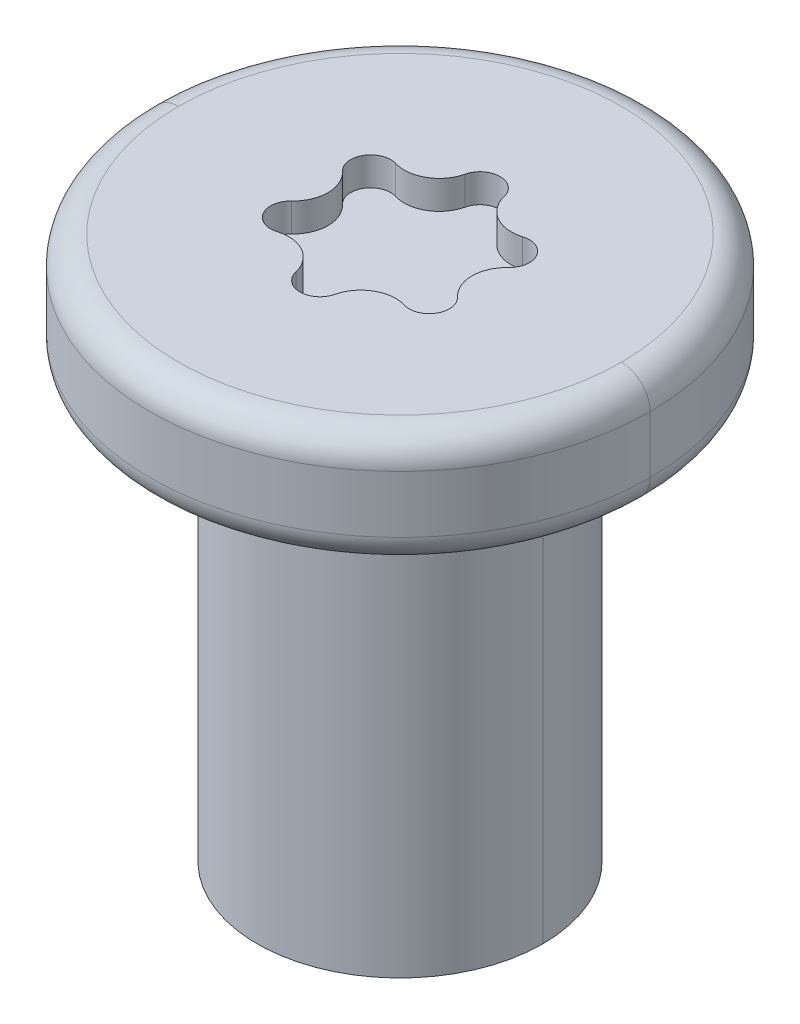
ISO-10303-21;
HEADER;
FILE_DESCRIPTION(('STEP AP214'),'2;1');
FILE_NAME('part.step','',(''),(''),'','','');
FILE_SCHEMA(('AUTOMOTIVE_DESIGN { 1 0 10303 214 1 1 1 1 }'));
ENDSEC;
DATA;
#1=APPLICATION_CONTEXT('core data for automotive mechanical design processes');
#2=APPLICATION_PROTOCOL_DEFINITION('international standard','automotive_design',2000,#1);
#3=PRODUCT_CONTEXT('',#1,'mechanical');
#4=PRODUCT('Part','Part','',(#3));
#5=PRODUCT_RELATED_PRODUCT_CATEGORY('part','',(#4));
#6=PRODUCT_DEFINITION_FORMATION('','',#4);
#7=PRODUCT_DEFINITION_CONTEXT('part definition',#1,'design');
#8=PRODUCT_DEFINITION('design','',#6,#7);
#9=PRODUCT_DEFINITION_SHAPE('','',#8);
#10=(LENGTH_UNIT() NAMED_UNIT(*) SI_UNIT(.MILLI.,.METRE.));
#11=(NAMED_UNIT(*) PLANE_ANGLE_UNIT() SI_UNIT($,.RADIAN.));
#12=(NAMED_UNIT(*) SI_UNIT($,.STERADIAN.) SOLID_ANGLE_UNIT());
#13=UNCERTAINTY_MEASURE_WITH_UNIT(LENGTH_MEASURE(1.E-05),#10,'distance_accuracy_value','');
#14=(GEOMETRIC_REPRESENTATION_CONTEXT(3) GLOBAL_UNCERTAINTY_ASSIGNED_CONTEXT((#13)) GLOBAL_UNIT_ASSIGNED_CONTEXT((#10,
#11,#12)) REPRESENTATION_CONTEXT('',''));
#15=CARTESIAN_POINT('',(0.,0.,0.));
#16=DIRECTION('',(0.,0.,1.));
#17=DIRECTION('',(1.,0.,0.));
#18=AXIS2_PLACEMENT_3D('',#15,#16,#17);
#19=CARTESIAN_POINT('',(0.,-3.,0.));
#20=DIRECTION('',(0.,-1.,0.));
#21=DIRECTION('',(1.,0.,0.));
#22=AXIS2_PLACEMENT_3D('',#19,#20,#21);
#23=CYLINDRICAL_SURFACE('',#22,1.);
#24=DIRECTION('',(0.,-1.,0.));
#25=VECTOR('',#24,1.);
#26=CARTESIAN_POINT('',(1.,0.,0.));
#27=LINE('',#26,#25);
#28=CARTESIAN_POINT('',(1.,0.,0.));
#29=VERTEX_POINT('',#28);
#30=CARTESIAN_POINT('',(1.,-3.,0.));
#31=VERTEX_POINT('',#30);
#32=EDGE_CURVE('E326',#29,#31,#27,.T.);
#33=ORIENTED_EDGE('',*,*,#32,.T.);
#34=CARTESIAN_POINT('',(0.,-3.,0.));
#35=DIRECTION('',(0.,1.,0.));
#36=DIRECTION('',(1.,0.,0.));
#37=AXIS2_PLACEMENT_3D('',#34,#35,#36);
#38=CIRCLE('',#37,1.);
#39=CARTESIAN_POINT('',(-1.,-3.,0.));
#40=VERTEX_POINT('',#39);
#41=EDGE_CURVE('E299',#31,#40,#38,.T.);
#42=ORIENTED_EDGE('',*,*,#41,.T.);
#43=DIRECTION('',(0.,-1.,0.));
#44=VECTOR('',#43,1.);
#45=CARTESIAN_POINT('',(-1.,0.,0.));
#46=LINE('',#45,#44);
#47=CARTESIAN_POINT('',(-1.,0.,0.));
#48=VERTEX_POINT('',#47);
#49=EDGE_CURVE('E324',#48,#40,#46,.T.);
#50=ORIENTED_EDGE('',*,*,#49,.F.);
#51=CARTESIAN_POINT('',(0.,0.,0.));
#52=DIRECTION('',(0.,-1.,0.));
#53=DIRECTION('',(-1.,0.,0.));
#54=AXIS2_PLACEMENT_3D('',#51,#52,#53);
#55=CIRCLE('',#54,1.);
#56=EDGE_CURVE('E366',#48,#29,#55,.T.);
#57=ORIENTED_EDGE('',*,*,#56,.T.);
#58=EDGE_LOOP('',(#33,#42,#50,#57));
#59=FACE_BOUND('',#58,.T.);
#60=ADVANCED_FACE('F17',(#59),#23,.T.);
#61=CARTESIAN_POINT('',(0.,0.6,0.));
#62=DIRECTION('',(0.,1.,0.));
#63=DIRECTION('',(1.,0.,0.));
#64=AXIS2_PLACEMENT_3D('',#61,#62,#63);
#65=PLANE('',#64);
#66=CARTESIAN_POINT('',(-0.3742615386137,0.6,0.6482400001978));
#67=DIRECTION('',(0.,1.,0.));
#68=DIRECTION('',(0.,0.,-1.));
#69=AXIS2_PLACEMENT_3D('',#66,#67,#68);
#70=CIRCLE('',#69,0.2445230772273);
#71=CARTESIAN_POINT('',(-0.3742615386137,0.6,0.4037169229705));
#72=VERTEX_POINT('',#71);
#73=CARTESIAN_POINT('',(-0.444665133717,0.6,0.4140715371349));
#74=VERTEX_POINT('',#73);
#75=EDGE_CURVE('E11',#72,#74,#70,.T.);
#76=ORIENTED_EDGE('',*,*,#75,.F.);
#77=CARTESIAN_POINT('',(-0.3742615386137,0.6,0.6482400001978));
#78=DIRECTION('',(0.,1.,0.));
#79=DIRECTION('',(0.973313594893476,0.,-0.229479075289095));
#80=AXIS2_PLACEMENT_3D('',#77,#78,#79);
#81=CIRCLE('',#80,0.2445230772273);
#82=CARTESIAN_POINT('',(-0.1362639032838,0.6,0.5921270705446));
#83=VERTEX_POINT('',#82);
#84=EDGE_CURVE('E28',#83,#72,#81,.T.);
#85=ORIENTED_EDGE('',*,*,#84,.F.);
#86=CARTESIAN_POINT('',(0.,0.6,0.56));
#87=DIRECTION('',(0.,-1.,0.));
#88=DIRECTION('',(0.,0.,1.));
#89=AXIS2_PLACEMENT_3D('',#86,#87,#88);
#90=CIRCLE('',#89,0.14);
#91=CARTESIAN_POINT('',(0.,0.6,0.7));
#92=VERTEX_POINT('',#91);
#93=EDGE_CURVE('E277',#92,#83,#90,.T.);
#94=ORIENTED_EDGE('',*,*,#93,.F.);
#95=CARTESIAN_POINT('',(0.,0.6,0.56));
#96=DIRECTION('',(0.,-1.,0.));
#97=DIRECTION('',(0.973313594914177,0.,0.229479075201295));
#98=AXIS2_PLACEMENT_3D('',#95,#96,#97);
#99=CIRCLE('',#98,0.14);
#100=CARTESIAN_POINT('',(0.1362639032863,0.6,0.5921270705379));
#101=VERTEX_POINT('',#100);
#102=EDGE_CURVE('E473',#101,#92,#99,.T.);
#103=ORIENTED_EDGE('',*,*,#102,.F.);
#104=CARTESIAN_POINT('',(0.3742615386137,0.6,0.6482400001978));
#105=DIRECTION('',(0.,1.,0.));
#106=DIRECTION('',(0.,0.,-1.));
#107=AXIS2_PLACEMENT_3D('',#104,#105,#106);
#108=CIRCLE('',#107,0.2445230772273);
#109=CARTESIAN_POINT('',(0.3742615386137,0.6,0.4037169229705));
#110=VERTEX_POINT('',#109);
#111=EDGE_CURVE('E447',#110,#101,#108,.T.);
#112=ORIENTED_EDGE('',*,*,#111,.F.);
#113=CARTESIAN_POINT('',(0.3742615386137,0.6,0.6482400001978));
#114=DIRECTION('',(0.,1.,0.));
#115=DIRECTION('',(0.287922088587999,0.,-0.957653836677494));
#116=AXIS2_PLACEMENT_3D('',#113,#114,#115);
#117=CIRCLE('',#116,0.2445230772273);
#118=CARTESIAN_POINT('',(0.4446651337169,0.6,0.4140715371349));
#119=VERTEX_POINT('',#118);
#120=EDGE_CURVE('E452',#119,#110,#117,.T.);
#121=ORIENTED_EDGE('',*,*,#120,.F.);
#122=CARTESIAN_POINT('',(0.4849742261193,0.6,0.28));
#123=DIRECTION('',(0.,-1.,0.));
#124=DIRECTION('',(0.,0.,1.));
#125=AXIS2_PLACEMENT_3D('',#122,#123,#124);
#126=CIRCLE('',#125,0.14);
#127=CARTESIAN_POINT('',(0.4849742261193,0.6,0.42));
#128=VERTEX_POINT('',#127);
#129=EDGE_CURVE('E348',#128,#119,#126,.T.);
#130=ORIENTED_EDGE('',*,*,#129,.F.);
#131=CARTESIAN_POINT('',(0.4849742261193,0.6,0.28));
#132=DIRECTION('',(0.,-1.,0.));
#133=DIRECTION('',(0.685391506307599,0.,-0.728174761359799));
#134=AXIS2_PLACEMENT_3D('',#131,#132,#133);
#135=CIRCLE('',#134,0.14);
#136=CARTESIAN_POINT('',(0.5809290370017,0.6,0.1780555334091));
#137=VERTEX_POINT('',#136);
#138=EDGE_CURVE('E353',#137,#128,#135,.T.);
#139=ORIENTED_EDGE('',*,*,#138,.F.);
#140=CARTESIAN_POINT('',(0.7485230772273,0.6,0.));
#141=DIRECTION('',(0.,1.,0.));
#142=DIRECTION('',(-0.685391506303787,0.,-0.728174761363387));
#143=AXIS2_PLACEMENT_3D('',#140,#141,#142);
#144=CIRCLE('',#143,0.2445230772273);
#145=CARTESIAN_POINT('',(0.5809290370012,0.6,-0.1780555334084));
#146=VERTEX_POINT('',#145);
#147=EDGE_CURVE('E485',#146,#137,#144,.T.);
#148=ORIENTED_EDGE('',*,*,#147,.F.);
#149=CARTESIAN_POINT('',(0.4849742261193,0.6,-0.28));
#150=DIRECTION('',(0.,-1.,0.));
#151=DIRECTION('',(0.,0.,-1.));
#152=AXIS2_PLACEMENT_3D('',#149,#150,#151);
#153=CIRCLE('',#152,0.14);
#154=CARTESIAN_POINT('',(0.4849742261193,0.6,-0.42));
#155=VERTEX_POINT('',#154);
#156=EDGE_CURVE('E459',#155,#146,#153,.T.);
#157=ORIENTED_EDGE('',*,*,#156,.F.);
#158=CARTESIAN_POINT('',(0.4849742261193,0.6,-0.28));
#159=DIRECTION('',(0.,-1.,0.));
#160=DIRECTION('',(-0.287922088587604,0.,-0.957653836677613));
#161=AXIS2_PLACEMENT_3D('',#158,#159,#160);
#162=CIRCLE('',#161,0.14);
#163=CARTESIAN_POINT('',(0.444665133717,0.6,-0.4140715371349));
#164=VERTEX_POINT('',#163);
#165=EDGE_CURVE('E464',#164,#155,#162,.T.);
#166=ORIENTED_EDGE('',*,*,#165,.F.);
#167=CARTESIAN_POINT('',(0.3742615386137,0.6,-0.6482400001978));
#168=DIRECTION('',(0.,1.,0.));
#169=DIRECTION('',(0.,0.,1.));
#170=AXIS2_PLACEMENT_3D('',#167,#168,#169);
#171=CIRCLE('',#170,0.2445230772273);
#172=CARTESIAN_POINT('',(0.3742615386137,0.6,-0.4037169229705));
#173=VERTEX_POINT('',#172);
#174=EDGE_CURVE('E388',#173,#164,#171,.T.);
#175=ORIENTED_EDGE('',*,*,#174,.F.);
#176=CARTESIAN_POINT('',(0.3742615386137,0.6,-0.6482400001978));
#177=DIRECTION('',(0.,1.,0.));
#178=DIRECTION('',(-0.973313594894913,0.,0.229479075283003));
#179=AXIS2_PLACEMENT_3D('',#176,#177,#178);
#180=CIRCLE('',#179,0.2445230772273);
#181=CARTESIAN_POINT('',(0.1362639032837,0.6,-0.592127070545));
#182=VERTEX_POINT('',#181);
#183=EDGE_CURVE('E393',#182,#173,#180,.T.);
#184=ORIENTED_EDGE('',*,*,#183,.F.);
#185=CARTESIAN_POINT('',(0.,0.6,-0.56));
#186=DIRECTION('',(0.,-1.,0.));
#187=DIRECTION('',(0.,0.,-1.));
#188=AXIS2_PLACEMENT_3D('',#185,#186,#187);
#189=CIRCLE('',#188,0.14);
#190=CARTESIAN_POINT('',(0.,0.6,-0.7));
#191=VERTEX_POINT('',#190);
#192=EDGE_CURVE('E382',#191,#182,#189,.T.);
#193=ORIENTED_EDGE('',*,*,#192,.F.);
#194=CARTESIAN_POINT('',(0.,0.6,-0.56));
#195=DIRECTION('',(0.,-1.,0.));
#196=DIRECTION('',(-0.973313594914177,0.,-0.229479075201295));
#197=AXIS2_PLACEMENT_3D('',#194,#195,#196);
#198=CIRCLE('',#197,0.14);
#199=CARTESIAN_POINT('',(-0.1362639032863,0.6,-0.5921270705379));
#200=VERTEX_POINT('',#199);
#201=EDGE_CURVE('E387',#200,#191,#198,.T.);
#202=ORIENTED_EDGE('',*,*,#201,.F.);
#203=CARTESIAN_POINT('',(-0.3742615386137,0.6,-0.6482400001978));
#204=DIRECTION('',(0.,1.,0.));
#205=DIRECTION('',(0.,0.,1.));
#206=AXIS2_PLACEMENT_3D('',#203,#204,#205);
#207=CIRCLE('',#206,0.2445230772273);
#208=CARTESIAN_POINT('',(-0.3742615386137,0.6,-0.4037169229705));
#209=VERTEX_POINT('',#208);
#210=EDGE_CURVE('E421',#209,#200,#207,.T.);
#211=ORIENTED_EDGE('',*,*,#210,.F.);
#212=CARTESIAN_POINT('',(-0.3742615386137,0.6,-0.6482400001978));
#213=DIRECTION('',(0.,1.,0.));
#214=DIRECTION('',(-0.287922088587696,0.,0.957653836677585));
#215=AXIS2_PLACEMENT_3D('',#212,#213,#214);
#216=CIRCLE('',#215,0.2445230772273);
#217=CARTESIAN_POINT('',(-0.4446651337169,0.6,-0.4140715371348));
#218=VERTEX_POINT('',#217);
#219=EDGE_CURVE('E364',#218,#209,#216,.T.);
#220=ORIENTED_EDGE('',*,*,#219,.F.);
#221=CARTESIAN_POINT('',(-0.4849742261193,0.6,-0.28));
#222=DIRECTION('',(0.,-1.,0.));
#223=DIRECTION('',(0.,0.,-1.));
#224=AXIS2_PLACEMENT_3D('',#221,#222,#223);
#225=CIRCLE('',#224,0.14);
#226=CARTESIAN_POINT('',(-0.4849742261193,0.6,-0.42));
#227=VERTEX_POINT('',#226);
#228=EDGE_CURVE('E365',#227,#218,#225,.T.);
#229=ORIENTED_EDGE('',*,*,#228,.F.);
#230=CARTESIAN_POINT('',(-0.4849742261193,0.6,-0.28));
#231=DIRECTION('',(0.,-1.,0.));
#232=DIRECTION('',(-0.685391506332275,0.,0.728174761336573));
#233=AXIS2_PLACEMENT_3D('',#230,#231,#232);
#234=CIRCLE('',#233,0.14);
#235=CARTESIAN_POINT('',(-0.5809290370028,0.6,-0.1780555334104));
#236=VERTEX_POINT('',#235);
#237=EDGE_CURVE('E312',#236,#227,#234,.T.);
#238=ORIENTED_EDGE('',*,*,#237,.F.);
#239=CARTESIAN_POINT('',(-0.7485230772273,0.6,0.));
#240=DIRECTION('',(0.,1.,0.));
#241=DIRECTION('',(0.685391506307237,0.,0.72817476136014));
#242=AXIS2_PLACEMENT_3D('',#239,#240,#241);
#243=CIRCLE('',#242,0.2445230772273);
#244=CARTESIAN_POINT('',(-0.5809290370009,0.6,0.1780555334081));
#245=VERTEX_POINT('',#244);
#246=EDGE_CURVE('E313',#245,#236,#243,.T.);
#247=ORIENTED_EDGE('',*,*,#246,.F.);
#248=CARTESIAN_POINT('',(-0.4849742261193,0.6,0.28));
#249=DIRECTION('',(0.,-1.,0.));
#250=DIRECTION('',(0.,0.,1.));
#251=AXIS2_PLACEMENT_3D('',#248,#249,#250);
#252=CIRCLE('',#251,0.14);
#253=CARTESIAN_POINT('',(-0.4849742261193,0.6,0.42));
#254=VERTEX_POINT('',#253);
#255=EDGE_CURVE('E374',#254,#245,#252,.T.);
#256=ORIENTED_EDGE('',*,*,#255,.F.);
#257=CARTESIAN_POINT('',(-0.4849742261193,0.6,0.28));
#258=DIRECTION('',(0.,-1.,0.));
#259=DIRECTION('',(0.287922088587815,0.,0.957653836677549));
#260=AXIS2_PLACEMENT_3D('',#257,#258,#259);
#261=CIRCLE('',#260,0.14);
#262=EDGE_CURVE('E370',#74,#254,#261,.T.);
#263=ORIENTED_EDGE('',*,*,#262,.F.);
#264=EDGE_LOOP('',(#76,#85,#94,#103,#112,#121,#130,#139,#148,#157,#166,#175,#184,#193,#202,#211,
#220,#229,#238,#247,#256,#263));
#265=FACE_BOUND('',#264,.T.);
#266=ADVANCED_FACE('F639',(#265),#65,.T.);
#267=CARTESIAN_POINT('',(-0.3742615386137,0.8,0.6482400001978));
#268=DIRECTION('',(0.,1.,0.));
#269=DIRECTION('',(0.,0.,-1.));
#270=AXIS2_PLACEMENT_3D('',#267,#268,#269);
#271=CYLINDRICAL_SURFACE('',#270,0.2445230772273);
#272=DIRECTION('',(1.224534362798E-11,-1.,3.327949027465E-11));
#273=VECTOR('',#272,1.);
#274=CARTESIAN_POINT('',(-0.1362639032863,0.8,0.5921270705379));
#275=LINE('',#274,#273);
#276=CARTESIAN_POINT('',(-0.136263903288,0.8,0.5921270705283));
#277=VERTEX_POINT('',#276);
#278=EDGE_CURVE('E269',#277,#83,#275,.T.);
#279=ORIENTED_EDGE('',*,*,#278,.T.);
#280=ORIENTED_EDGE('',*,*,#84,.T.);
#281=ORIENTED_EDGE('',*,*,#75,.T.);
#282=DIRECTION('',(0.,-1.,0.));
#283=VECTOR('',#282,1.);
#284=CARTESIAN_POINT('',(-0.444665133717,0.8,0.4140715371349));
#285=LINE('',#284,#283);
#286=CARTESIAN_POINT('',(-0.444665133717,0.8,0.4140715371349));
#287=VERTEX_POINT('',#286);
#288=EDGE_CURVE('E375',#287,#74,#285,.T.);
#289=ORIENTED_EDGE('',*,*,#288,.F.);
#290=CARTESIAN_POINT('',(-0.3742615386137,0.8,0.6482400001978));
#291=DIRECTION('',(0.,-1.,0.));
#292=DIRECTION('',(-0.287922088588118,0.,-0.957653836677458));
#293=AXIS2_PLACEMENT_3D('',#290,#291,#292);
#294=CIRCLE('',#293,0.2445230772273);
#295=CARTESIAN_POINT('',(-0.3742615386137,0.8,0.4037169229705));
#296=VERTEX_POINT('',#295);
#297=EDGE_CURVE('E262',#287,#296,#294,.T.);
#298=ORIENTED_EDGE('',*,*,#297,.T.);
#299=CARTESIAN_POINT('',(-0.3742615386137,0.8,0.6482400001978));
#300=DIRECTION('',(0.,-1.,0.));
#301=DIRECTION('',(0.,0.,-1.));
#302=AXIS2_PLACEMENT_3D('',#299,#300,#301);
#303=CIRCLE('',#302,0.2445230772273);
#304=EDGE_CURVE('E280',#296,#277,#303,.T.);
#305=ORIENTED_EDGE('',*,*,#304,.T.);
#306=EDGE_LOOP('',(#279,#280,#281,#289,#298,#305));
#307=FACE_BOUND('',#306,.T.);
#308=ADVANCED_FACE('F19',(#307),#271,.T.);
#309=CARTESIAN_POINT('',(0.,0.8,0.56));
#310=DIRECTION('',(0.,1.,0.));
#311=DIRECTION('',(0.,0.,-1.));
#312=AXIS2_PLACEMENT_3D('',#309,#310,#311);
#313=CYLINDRICAL_SURFACE('',#312,0.14);
#314=DIRECTION('',(1.236163948981E-11,-1.,-3.359201805608E-11));
#315=VECTOR('',#314,1.);
#316=CARTESIAN_POINT('',(0.1362639032838,0.8,0.5921270705446));
#317=LINE('',#316,#315);
#318=CARTESIAN_POINT('',(0.1362639032831,0.8,0.5921270705489));
#319=VERTEX_POINT('',#318);
#320=EDGE_CURVE('E451',#319,#101,#317,.T.);
#321=ORIENTED_EDGE('',*,*,#320,.T.);
#322=ORIENTED_EDGE('',*,*,#102,.T.);
#323=ORIENTED_EDGE('',*,*,#93,.T.);
#324=ORIENTED_EDGE('',*,*,#278,.F.);
#325=CARTESIAN_POINT('',(0.,0.8,0.56));
#326=DIRECTION('',(0.,1.,0.));
#327=DIRECTION('',(-0.97331359491406,0.,0.229479075201791));
#328=AXIS2_PLACEMENT_3D('',#325,#326,#327);
#329=CIRCLE('',#328,0.14);
#330=CARTESIAN_POINT('',(0.,0.8,0.7));
#331=VERTEX_POINT('',#330);
#332=EDGE_CURVE('E274',#277,#331,#329,.T.);
#333=ORIENTED_EDGE('',*,*,#332,.T.);
#334=CARTESIAN_POINT('',(0.,0.8,0.56));
#335=DIRECTION('',(0.,1.,0.));
#336=DIRECTION('',(0.,0.,1.));
#337=AXIS2_PLACEMENT_3D('',#334,#335,#336);
#338=CIRCLE('',#337,0.14);
#339=EDGE_CURVE('E21',#331,#319,#338,.T.);
#340=ORIENTED_EDGE('',*,*,#339,.T.);
#341=EDGE_LOOP('',(#321,#322,#323,#324,#333,#340));
#342=FACE_BOUND('',#341,.T.);
#343=ADVANCED_FACE('F271',(#342),#313,.F.);
#344=CARTESIAN_POINT('',(0.3742615386137,0.8,0.6482400001978));
#345=DIRECTION('',(0.,1.,0.));
#346=DIRECTION('',(0.,0.,-1.));
#347=AXIS2_PLACEMENT_3D('',#344,#345,#346);
#348=CYLINDRICAL_SURFACE('',#347,0.2445230772273);
#349=DIRECTION('',(0.,-1.,0.));
#350=VECTOR('',#349,1.);
#351=CARTESIAN_POINT('',(0.4446651337169,0.8,0.4140715371349));
#352=LINE('',#351,#350);
#353=CARTESIAN_POINT('',(0.4446651337169,0.8,0.4140715371349));
#354=VERTEX_POINT('',#353);
#355=EDGE_CURVE('E352',#354,#119,#352,.T.);
#356=ORIENTED_EDGE('',*,*,#355,.T.);
#357=ORIENTED_EDGE('',*,*,#120,.T.);
#358=ORIENTED_EDGE('',*,*,#111,.T.);
#359=ORIENTED_EDGE('',*,*,#320,.F.);
#360=CARTESIAN_POINT('',(0.3742615386137,0.8,0.6482400001978));
#361=DIRECTION('',(0.,-1.,0.));
#362=DIRECTION('',(-0.973313594893571,0.,-0.229479075288693));
#363=AXIS2_PLACEMENT_3D('',#360,#361,#362);
#364=CIRCLE('',#363,0.2445230772273);
#365=CARTESIAN_POINT('',(0.3742615386137,0.8,0.4037169229705));
#366=VERTEX_POINT('',#365);
#367=EDGE_CURVE('E294',#319,#366,#364,.T.);
#368=ORIENTED_EDGE('',*,*,#367,.T.);
#369=CARTESIAN_POINT('',(0.3742615386137,0.8,0.6482400001978));
#370=DIRECTION('',(0.,-1.,0.));
#371=DIRECTION('',(0.,0.,-1.));
#372=AXIS2_PLACEMENT_3D('',#369,#370,#371);
#373=CIRCLE('',#372,0.2445230772273);
#374=EDGE_CURVE('E322',#366,#354,#373,.T.);
#375=ORIENTED_EDGE('',*,*,#374,.T.);
#376=EDGE_LOOP('',(#356,#357,#358,#359,#368,#375));
#377=FACE_BOUND('',#376,.T.);
#378=ADVANCED_FACE('F648',(#377),#348,.T.);
#379=CARTESIAN_POINT('',(0.4849742261193,0.8,0.28));
#380=DIRECTION('',(0.,1.,0.));
#381=DIRECTION('',(0.,0.,-1.));
#382=AXIS2_PLACEMENT_3D('',#379,#380,#381);
#383=CYLINDRICAL_SURFACE('',#382,0.14);
#384=DIRECTION('',(6.272760089132E-13,-1.,8.315570454442E-13));
#385=VECTOR('',#384,1.);
#386=CARTESIAN_POINT('',(0.5809290370016,0.8,0.1780555334089));
#387=LINE('',#386,#385);
#388=CARTESIAN_POINT('',(0.5809290370019,0.8,0.1780555334092));
#389=VERTEX_POINT('',#388);
#390=EDGE_CURVE('E489',#389,#137,#387,.T.);
#391=ORIENTED_EDGE('',*,*,#390,.T.);
#392=ORIENTED_EDGE('',*,*,#138,.T.);
#393=ORIENTED_EDGE('',*,*,#129,.T.);
#394=ORIENTED_EDGE('',*,*,#355,.F.);
#395=CARTESIAN_POINT('',(0.4849742261193,0.8,0.28));
#396=DIRECTION('',(0.,1.,0.));
#397=DIRECTION('',(-0.28792208858821,0.,0.957653836677431));
#398=AXIS2_PLACEMENT_3D('',#395,#396,#397);
#399=CIRCLE('',#398,0.14);
#400=CARTESIAN_POINT('',(0.4849742261193,0.8,0.42));
#401=VERTEX_POINT('',#400);
#402=EDGE_CURVE('E319',#354,#401,#399,.T.);
#403=ORIENTED_EDGE('',*,*,#402,.T.);
#404=CARTESIAN_POINT('',(0.4849742261193,0.8,0.28));
#405=DIRECTION('',(0.,1.,0.));
#406=DIRECTION('',(0.,0.,1.));
#407=AXIS2_PLACEMENT_3D('',#404,#405,#406);
#408=CIRCLE('',#407,0.14);
#409=EDGE_CURVE('E323',#401,#389,#408,.T.);
#410=ORIENTED_EDGE('',*,*,#409,.T.);
#411=EDGE_LOOP('',(#391,#392,#393,#394,#403,#410));
#412=FACE_BOUND('',#411,.T.);
#413=ADVANCED_FACE('F645',(#412),#383,.F.);
#414=CARTESIAN_POINT('',(0.7485230772273,0.8,0.));
#415=DIRECTION('',(0.,1.,0.));
#416=DIRECTION('',(0.,0.,-1.));
#417=AXIS2_PLACEMENT_3D('',#414,#415,#416);
#418=CYLINDRICAL_SURFACE('',#417,0.2445230772273);
#419=DIRECTION('',(-2.456923553495E-12,-1.,2.872424520461E-12));
#420=VECTOR('',#419,1.);
#421=CARTESIAN_POINT('',(0.5809290370017,0.8,-0.178055533409));
#422=LINE('',#421,#420);
#423=CARTESIAN_POINT('',(0.5809290370021,0.8,-0.1780555334094));
#424=VERTEX_POINT('',#423);
#425=EDGE_CURVE('E463',#424,#146,#422,.T.);
#426=ORIENTED_EDGE('',*,*,#425,.T.);
#427=ORIENTED_EDGE('',*,*,#147,.T.);
#428=ORIENTED_EDGE('',*,*,#390,.F.);
#429=CARTESIAN_POINT('',(0.7485230772273,0.8,0.));
#430=DIRECTION('',(0.,-1.,0.));
#431=DIRECTION('',(-0.685391506297811,0.,0.728174761369012));
#432=AXIS2_PLACEMENT_3D('',#429,#430,#431);
#433=CIRCLE('',#432,0.2445230772273);
#434=EDGE_CURVE('E542',#389,#424,#433,.T.);
#435=ORIENTED_EDGE('',*,*,#434,.T.);
#436=EDGE_LOOP('',(#426,#427,#428,#435));
#437=FACE_BOUND('',#436,.T.);
#438=ADVANCED_FACE('F587',(#437),#418,.T.);
#439=CARTESIAN_POINT('',(0.4849742261193,0.8,-0.28));
#440=DIRECTION('',(0.,1.,0.));
#441=DIRECTION('',(0.,0.,-1.));
#442=AXIS2_PLACEMENT_3D('',#439,#440,#441);
#443=CYLINDRICAL_SURFACE('',#442,0.14);
#444=DIRECTION('',(0.,-1.,0.));
#445=VECTOR('',#444,1.);
#446=CARTESIAN_POINT('',(0.444665133717,0.8,-0.4140715371349));
#447=LINE('',#446,#445);
#448=CARTESIAN_POINT('',(0.444665133717,0.8,-0.4140715371349));
#449=VERTEX_POINT('',#448);
#450=EDGE_CURVE('E392',#449,#164,#447,.T.);
#451=ORIENTED_EDGE('',*,*,#450,.T.);
#452=ORIENTED_EDGE('',*,*,#165,.T.);
#453=ORIENTED_EDGE('',*,*,#156,.T.);
#454=ORIENTED_EDGE('',*,*,#425,.F.);
#455=CARTESIAN_POINT('',(0.4849742261193,0.8,-0.28));
#456=DIRECTION('',(0.,1.,0.));
#457=DIRECTION('',(0.68539150630559,0.,0.72817476136169));
#458=AXIS2_PLACEMENT_3D('',#455,#456,#457);
#459=CIRCLE('',#458,0.14);
#460=CARTESIAN_POINT('',(0.4849742261193,0.8,-0.42));
#461=VERTEX_POINT('',#460);
#462=EDGE_CURVE('E407',#424,#461,#459,.T.);
#463=ORIENTED_EDGE('',*,*,#462,.T.);
#464=CARTESIAN_POINT('',(0.4849742261193,0.8,-0.28));
#465=DIRECTION('',(0.,1.,0.));
#466=DIRECTION('',(0.,0.,-1.));
#467=AXIS2_PLACEMENT_3D('',#464,#465,#466);
#468=CIRCLE('',#467,0.14);
#469=EDGE_CURVE('E403',#461,#449,#468,.T.);
#470=ORIENTED_EDGE('',*,*,#469,.T.);
#471=EDGE_LOOP('',(#451,#452,#453,#454,#463,#470));
#472=FACE_BOUND('',#471,.T.);
#473=ADVANCED_FACE('F592',(#472),#443,.F.);
#474=CARTESIAN_POINT('',(0.3742615386137,0.8,-0.6482400001978));
#475=DIRECTION('',(0.,1.,0.));
#476=DIRECTION('',(0.,0.,-1.));
#477=AXIS2_PLACEMENT_3D('',#474,#475,#476);
#478=CYLINDRICAL_SURFACE('',#477,0.2445230772273);
#479=DIRECTION('',(-1.356095791216E-11,-1.,-3.669620163294E-11));
#480=VECTOR('',#479,1.);
#481=CARTESIAN_POINT('',(0.1362639032864,0.8,-0.5921270705376));
#482=LINE('',#481,#480);
#483=CARTESIAN_POINT('',(0.1362639032882,0.8,-0.5921270705277));
#484=VERTEX_POINT('',#483);
#485=EDGE_CURVE('E386',#484,#182,#482,.T.);
#486=ORIENTED_EDGE('',*,*,#485,.T.);
#487=ORIENTED_EDGE('',*,*,#183,.T.);
#488=ORIENTED_EDGE('',*,*,#174,.T.);
#489=ORIENTED_EDGE('',*,*,#450,.F.);
#490=CARTESIAN_POINT('',(0.3742615386137,0.8,-0.6482400001978));
#491=DIRECTION('',(0.,-1.,0.));
#492=DIRECTION('',(0.287922088588209,0.,0.957653836677431));
#493=AXIS2_PLACEMENT_3D('',#490,#491,#492);
#494=CIRCLE('',#493,0.2445230772273);
#495=CARTESIAN_POINT('',(0.3742615386137,0.8,-0.4037169229705));
#496=VERTEX_POINT('',#495);
#497=EDGE_CURVE('E408',#449,#496,#494,.T.);
#498=ORIENTED_EDGE('',*,*,#497,.T.);
#499=CARTESIAN_POINT('',(0.3742615386137,0.8,-0.6482400001978));
#500=DIRECTION('',(0.,-1.,0.));
#501=DIRECTION('',(0.,0.,1.));
#502=AXIS2_PLACEMENT_3D('',#499,#500,#501);
#503=CIRCLE('',#502,0.2445230772273);
#504=EDGE_CURVE('E495',#496,#484,#503,.T.);
#505=ORIENTED_EDGE('',*,*,#504,.T.);
#506=EDGE_LOOP('',(#486,#487,#488,#489,#498,#505));
#507=FACE_BOUND('',#506,.T.);
#508=ADVANCED_FACE('F669',(#507),#478,.T.);
#509=CARTESIAN_POINT('',(0.,0.8,-0.56));
#510=DIRECTION('',(0.,1.,0.));
#511=DIRECTION('',(0.,0.,-1.));
#512=AXIS2_PLACEMENT_3D('',#509,#510,#511);
#513=CYLINDRICAL_SURFACE('',#512,0.14);
#514=DIRECTION('',(-1.236122315618E-11,-1.,3.359035272155E-11));
#515=VECTOR('',#514,1.);
#516=CARTESIAN_POINT('',(-0.1362639032838,0.8,-0.5921270705446));
#517=LINE('',#516,#515);
#518=CARTESIAN_POINT('',(-0.1362639032831,0.8,-0.5921270705489));
#519=VERTEX_POINT('',#518);
#520=EDGE_CURVE('E425',#519,#200,#517,.T.);
#521=ORIENTED_EDGE('',*,*,#520,.T.);
#522=ORIENTED_EDGE('',*,*,#201,.T.);
#523=ORIENTED_EDGE('',*,*,#192,.T.);
#524=ORIENTED_EDGE('',*,*,#485,.F.);
#525=CARTESIAN_POINT('',(0.,0.8,-0.56));
#526=DIRECTION('',(0.,1.,0.));
#527=DIRECTION('',(0.973313594915073,0.,-0.229479075197493));
#528=AXIS2_PLACEMENT_3D('',#525,#526,#527);
#529=CIRCLE('',#528,0.14);
#530=CARTESIAN_POINT('',(0.,0.8,-0.7));
#531=VERTEX_POINT('',#530);
#532=EDGE_CURVE('E380',#484,#531,#529,.T.);
#533=ORIENTED_EDGE('',*,*,#532,.T.);
#534=CARTESIAN_POINT('',(0.,0.8,-0.56));
#535=DIRECTION('',(0.,1.,0.));
#536=DIRECTION('',(0.,0.,-1.));
#537=AXIS2_PLACEMENT_3D('',#534,#535,#536);
#538=CIRCLE('',#537,0.14);
#539=EDGE_CURVE('E376',#531,#519,#538,.T.);
#540=ORIENTED_EDGE('',*,*,#539,.T.);
#541=EDGE_LOOP('',(#521,#522,#523,#524,#533,#540));
#542=FACE_BOUND('',#541,.T.);
#543=ADVANCED_FACE('F654',(#542),#513,.F.);
#544=CARTESIAN_POINT('',(-0.3742615386137,0.8,-0.6482400001978));
#545=DIRECTION('',(0.,1.,0.));
#546=DIRECTION('',(0.,0.,-1.));
#547=AXIS2_PLACEMENT_3D('',#544,#545,#546);
#548=CYLINDRICAL_SURFACE('',#547,0.2445230772273);
#549=DIRECTION('',(0.,-1.,0.));
#550=VECTOR('',#549,1.);
#551=CARTESIAN_POINT('',(-0.4446651337169,0.8,-0.4140715371348));
#552=LINE('',#551,#550);
#553=CARTESIAN_POINT('',(-0.4446651337169,0.8,-0.4140715371349));
#554=VERTEX_POINT('',#553);
#555=EDGE_CURVE('E360',#554,#218,#552,.T.);
#556=ORIENTED_EDGE('',*,*,#555,.T.);
#557=ORIENTED_EDGE('',*,*,#219,.T.);
#558=ORIENTED_EDGE('',*,*,#210,.T.);
#559=ORIENTED_EDGE('',*,*,#520,.F.);
#560=CARTESIAN_POINT('',(-0.3742615386137,0.8,-0.6482400001978));
#561=DIRECTION('',(0.,-1.,0.));
#562=DIRECTION('',(0.973313594893571,0.,0.229479075288693));
#563=AXIS2_PLACEMENT_3D('',#560,#561,#562);
#564=CIRCLE('',#563,0.2445230772273);
#565=CARTESIAN_POINT('',(-0.3742615386137,0.8,-0.4037169229705));
#566=VERTEX_POINT('',#565);
#567=EDGE_CURVE('E381',#519,#566,#564,.T.);
#568=ORIENTED_EDGE('',*,*,#567,.T.);
#569=CARTESIAN_POINT('',(-0.3742615386137,0.8,-0.6482400001978));
#570=DIRECTION('',(0.,-1.,0.));
#571=DIRECTION('',(0.,0.,1.));
#572=AXIS2_PLACEMENT_3D('',#569,#570,#571);
#573=CIRCLE('',#572,0.2445230772273);
#574=EDGE_CURVE('E446',#566,#554,#573,.T.);
#575=ORIENTED_EDGE('',*,*,#574,.T.);
#576=EDGE_LOOP('',(#556,#557,#558,#559,#568,#575));
#577=FACE_BOUND('',#576,.T.);
#578=ADVANCED_FACE('F650',(#577),#548,.T.);
#579=CARTESIAN_POINT('',(-0.4849742261193,0.8,-0.28));
#580=DIRECTION('',(0.,1.,0.));
#581=DIRECTION('',(0.,0.,-1.));
#582=AXIS2_PLACEMENT_3D('',#579,#580,#581);
#583=CYLINDRICAL_SURFACE('',#582,0.14);
#584=DIRECTION('',(-5.598854713185E-12,-1.,-6.708661404176E-12));
#585=VECTOR('',#584,1.);
#586=CARTESIAN_POINT('',(-0.5809290370017,0.8,-0.178055533409));
#587=LINE('',#586,#585);
#588=CARTESIAN_POINT('',(-0.580929037002,0.8,-0.1780555334093));
#589=VERTEX_POINT('',#588);
#590=EDGE_CURVE('E308',#589,#236,#587,.T.);
#591=ORIENTED_EDGE('',*,*,#590,.T.);
#592=ORIENTED_EDGE('',*,*,#237,.T.);
#593=ORIENTED_EDGE('',*,*,#228,.T.);
#594=ORIENTED_EDGE('',*,*,#555,.F.);
#595=CARTESIAN_POINT('',(-0.4849742261193,0.8,-0.28));
#596=DIRECTION('',(0.,1.,0.));
#597=DIRECTION('',(0.287922088588512,0.,-0.95765383667734));
#598=AXIS2_PLACEMENT_3D('',#595,#596,#597);
#599=CIRCLE('',#598,0.14);
#600=CARTESIAN_POINT('',(-0.4849742261193,0.8,-0.42));
#601=VERTEX_POINT('',#600);
#602=EDGE_CURVE('E297',#554,#601,#599,.T.);
#603=ORIENTED_EDGE('',*,*,#602,.T.);
#604=CARTESIAN_POINT('',(-0.4849742261193,0.8,-0.28));
#605=DIRECTION('',(0.,1.,0.));
#606=DIRECTION('',(0.,0.,-1.));
#607=AXIS2_PLACEMENT_3D('',#604,#605,#606);
#608=CIRCLE('',#607,0.14);
#609=EDGE_CURVE('E434',#601,#589,#608,.T.);
#610=ORIENTED_EDGE('',*,*,#609,.T.);
#611=EDGE_LOOP('',(#591,#592,#593,#594,#603,#610));
#612=FACE_BOUND('',#611,.T.);
#613=ADVANCED_FACE('F653',(#612),#583,.F.);
#614=CARTESIAN_POINT('',(-0.7485230772273,0.8,0.));
#615=DIRECTION('',(0.,1.,0.));
#616=DIRECTION('',(0.,0.,-1.));
#617=AXIS2_PLACEMENT_3D('',#614,#615,#616);
#618=CYLINDRICAL_SURFACE('',#617,0.2445230772273);
#619=DIRECTION('',(3.548827898214E-12,-1.,-4.22287205204E-12));
#620=VECTOR('',#619,1.);
#621=CARTESIAN_POINT('',(-0.5809290370016,0.8,0.178055533409));
#622=LINE('',#621,#620);
#623=CARTESIAN_POINT('',(-0.580929037002,0.8,0.1780555334093));
#624=VERTEX_POINT('',#623);
#625=EDGE_CURVE('E442',#624,#245,#622,.T.);
#626=ORIENTED_EDGE('',*,*,#625,.T.);
#627=ORIENTED_EDGE('',*,*,#246,.T.);
#628=ORIENTED_EDGE('',*,*,#590,.F.);
#629=CARTESIAN_POINT('',(-0.7485230772273,0.8,0.));
#630=DIRECTION('',(0.,-1.,0.));
#631=DIRECTION('',(0.685391506297297,0.,-0.728174761369496));
#632=AXIS2_PLACEMENT_3D('',#629,#630,#631);
#633=CIRCLE('',#632,0.2445230772273);
#634=EDGE_CURVE('E438',#589,#624,#633,.T.);
#635=ORIENTED_EDGE('',*,*,#634,.T.);
#636=EDGE_LOOP('',(#626,#627,#628,#635));
#637=FACE_BOUND('',#636,.T.);
#638=ADVANCED_FACE('F662',(#637),#618,.T.);
#639=CARTESIAN_POINT('',(-0.4849742261193,0.8,0.28));
#640=DIRECTION('',(0.,1.,0.));
#641=DIRECTION('',(0.,0.,-1.));
#642=AXIS2_PLACEMENT_3D('',#639,#640,#641);
#643=CYLINDRICAL_SURFACE('',#642,0.14);
#644=ORIENTED_EDGE('',*,*,#288,.T.);
#645=ORIENTED_EDGE('',*,*,#262,.T.);
#646=ORIENTED_EDGE('',*,*,#255,.T.);
#647=ORIENTED_EDGE('',*,*,#625,.F.);
#648=CARTESIAN_POINT('',(-0.4849742261193,0.8,0.28));
#649=DIRECTION('',(0.,1.,0.));
#650=DIRECTION('',(-0.685391506304973,0.,-0.728174761362271));
#651=AXIS2_PLACEMENT_3D('',#648,#649,#650);
#652=CIRCLE('',#651,0.14);
#653=CARTESIAN_POINT('',(-0.4849742261193,0.8,0.42));
#654=VERTEX_POINT('',#653);
#655=EDGE_CURVE('E307',#624,#654,#652,.T.);
#656=ORIENTED_EDGE('',*,*,#655,.T.);
#657=CARTESIAN_POINT('',(-0.4849742261193,0.8,0.28));
#658=DIRECTION('',(0.,1.,0.));
#659=DIRECTION('',(0.,0.,1.));
#660=AXIS2_PLACEMENT_3D('',#657,#658,#659);
#661=CIRCLE('',#660,0.14);
#662=EDGE_CURVE('E303',#654,#287,#661,.T.);
#663=ORIENTED_EDGE('',*,*,#662,.T.);
#664=EDGE_LOOP('',(#644,#645,#646,#647,#656,#663));
#665=FACE_BOUND('',#664,.T.);
#666=ADVANCED_FACE('F665',(#665),#643,.F.);
#667=CARTESIAN_POINT('',(0.,0.8,0.));
#668=DIRECTION('',(0.,1.,0.));
#669=DIRECTION('',(1.,0.,0.));
#670=AXIS2_PLACEMENT_3D('',#667,#668,#669);
#671=PLANE('',#670);
#672=ORIENTED_EDGE('',*,*,#634,.F.);
#673=ORIENTED_EDGE('',*,*,#609,.F.);
#674=ORIENTED_EDGE('',*,*,#602,.F.);
#675=ORIENTED_EDGE('',*,*,#574,.F.);
#676=ORIENTED_EDGE('',*,*,#567,.F.);
#677=ORIENTED_EDGE('',*,*,#539,.F.);
#678=ORIENTED_EDGE('',*,*,#532,.F.);
#679=ORIENTED_EDGE('',*,*,#504,.F.);
#680=ORIENTED_EDGE('',*,*,#497,.F.);
#681=ORIENTED_EDGE('',*,*,#469,.F.);
#682=ORIENTED_EDGE('',*,*,#462,.F.);
#683=ORIENTED_EDGE('',*,*,#434,.F.);
#684=ORIENTED_EDGE('',*,*,#409,.F.);
#685=ORIENTED_EDGE('',*,*,#402,.F.);
#686=ORIENTED_EDGE('',*,*,#374,.F.);
#687=ORIENTED_EDGE('',*,*,#367,.F.);
#688=ORIENTED_EDGE('',*,*,#339,.F.);
#689=ORIENTED_EDGE('',*,*,#332,.F.);
#690=ORIENTED_EDGE('',*,*,#304,.F.);
#691=ORIENTED_EDGE('',*,*,#297,.F.);
#692=ORIENTED_EDGE('',*,*,#662,.F.);
#693=ORIENTED_EDGE('',*,*,#655,.F.);
#694=EDGE_LOOP('',(#672,#673,#674,#675,#676,#677,#678,#679,#680,#681,#682,#683,#684,#685,#686,
#687,#688,#689,#690,#691,#692,#693));
#695=FACE_BOUND('',#694,.T.);
#696=CARTESIAN_POINT('',(0.,0.8,0.));
#697=DIRECTION('',(0.,1.,0.));
#698=DIRECTION('',(1.,0.,0.));
#699=AXIS2_PLACEMENT_3D('',#696,#697,#698);
#700=CIRCLE('',#699,1.55);
#701=CARTESIAN_POINT('',(1.55,0.8,-2.030424439692E-13));
#702=VERTEX_POINT('',#701);
#703=CARTESIAN_POINT('',(1.549978460272,0.8,-0.008171455930055));
#704=VERTEX_POINT('',#703);
#705=EDGE_CURVE('E358',#702,#704,#700,.T.);
#706=ORIENTED_EDGE('',*,*,#705,.T.);
#707=CARTESIAN_POINT('',(0.,0.8,0.));
#708=DIRECTION('',(0.,-1.,0.));
#709=DIRECTION('',(-1.,0.,0.));
#710=AXIS2_PLACEMENT_3D('',#707,#708,#709);
#711=CIRCLE('',#710,1.55);
#712=CARTESIAN_POINT('',(-1.55,0.8,1.001231867807E-13));
#713=VERTEX_POINT('',#712);
#714=EDGE_CURVE('E354',#713,#704,#711,.T.);
#715=ORIENTED_EDGE('',*,*,#714,.F.);
#716=CARTESIAN_POINT('',(0.,0.8,0.));
#717=DIRECTION('',(0.,1.,0.));
#718=DIRECTION('',(-1.,0.,0.));
#719=AXIS2_PLACEMENT_3D('',#716,#717,#718);
#720=CIRCLE('',#719,1.55);
#721=CARTESIAN_POINT('',(-1.549978460272,0.8,0.008171455929951));
#722=VERTEX_POINT('',#721);
#723=EDGE_CURVE('E318',#713,#722,#720,.T.);
#724=ORIENTED_EDGE('',*,*,#723,.T.);
#725=CARTESIAN_POINT('',(0.,0.8,0.));
#726=DIRECTION('',(0.,-1.,0.));
#727=DIRECTION('',(1.,0.,0.));
#728=AXIS2_PLACEMENT_3D('',#725,#726,#727);
#729=CIRCLE('',#728,1.55);
#730=EDGE_CURVE('E420',#702,#722,#729,.T.);
#731=ORIENTED_EDGE('',*,*,#730,.F.);
#732=EDGE_LOOP('',(#706,#715,#724,#731));
#733=FACE_BOUND('',#732,.T.);
#734=ADVANCED_FACE('F285',(#695,#733),#671,.T.);
#735=CARTESIAN_POINT('',(0.,0.,0.));
#736=DIRECTION('',(0.,1.,0.));
#737=DIRECTION('',(1.,0.,0.));
#738=AXIS2_PLACEMENT_3D('',#735,#736,#737);
#739=CYLINDRICAL_SURFACE('',#738,1.75);
#740=DIRECTION('',(0.,-1.,2.95669521852E-13));
#741=VECTOR('',#740,1.);
#742=CARTESIAN_POINT('',(-1.75,0.6,2.433066394689E-13));
#743=LINE('',#742,#741);
#744=CARTESIAN_POINT('',(-1.75,0.6,1.412281001474E-13));
#745=VERTEX_POINT('',#744);
#746=CARTESIAN_POINT('',(-1.75,0.2,5.802074098948E-13));
#747=VERTEX_POINT('',#746);
#748=EDGE_CURVE('E397',#745,#747,#743,.T.);
#749=ORIENTED_EDGE('',*,*,#748,.T.);
#750=CARTESIAN_POINT('',(0.,0.2,0.));
#751=DIRECTION('',(0.,1.,0.));
#752=DIRECTION('',(-1.,0.,0.));
#753=AXIS2_PLACEMENT_3D('',#750,#751,#752);
#754=CIRCLE('',#753,1.75);
#755=CARTESIAN_POINT('',(-1.749946918964,0.2,0.0136301434181));
#756=VERTEX_POINT('',#755);
#757=EDGE_CURVE('E162',#747,#756,#754,.T.);
#758=ORIENTED_EDGE('',*,*,#757,.T.);
#759=CARTESIAN_POINT('',(0.,0.2,0.));
#760=DIRECTION('',(0.,1.,0.));
#761=DIRECTION('',(-0.999969667979234,0.,0.00778865338176926));
#762=AXIS2_PLACEMENT_3D('',#759,#760,#761);
#763=CIRCLE('',#762,1.75);
#764=CARTESIAN_POINT('',(1.75,0.2,0.));
#765=VERTEX_POINT('',#764);
#766=EDGE_CURVE('E413',#756,#765,#763,.T.);
#767=ORIENTED_EDGE('',*,*,#766,.T.);
#768=DIRECTION('',(0.,1.,2.966431354029E-13));
#769=VECTOR('',#768,1.);
#770=CARTESIAN_POINT('',(1.75,0.2,-2.333445562273E-13));
#771=LINE('',#770,#769);
#772=CARTESIAN_POINT('',(1.75,0.6,0.));
#773=VERTEX_POINT('',#772);
#774=EDGE_CURVE('E175',#765,#773,#771,.T.);
#775=ORIENTED_EDGE('',*,*,#774,.T.);
#776=CARTESIAN_POINT('',(0.,0.6,0.));
#777=DIRECTION('',(0.,-1.,0.));
#778=DIRECTION('',(1.,0.,0.));
#779=AXIS2_PLACEMENT_3D('',#776,#777,#778);
#780=CIRCLE('',#779,1.75);
#781=CARTESIAN_POINT('',(-1.749975680953,0.6,0.009225837340266));
#782=VERTEX_POINT('',#781);
#783=EDGE_CURVE('E317',#773,#782,#780,.T.);
#784=ORIENTED_EDGE('',*,*,#783,.T.);
#785=CARTESIAN_POINT('',(0.,0.6,0.));
#786=DIRECTION('',(0.,-1.,0.));
#787=DIRECTION('',(-0.999986103401462,0.,0.0052719070515798));
#788=AXIS2_PLACEMENT_3D('',#785,#786,#787);
#789=CIRCLE('',#788,1.75);
#790=EDGE_CURVE('E314',#782,#745,#789,.T.);
#791=ORIENTED_EDGE('',*,*,#790,.T.);
#792=EDGE_LOOP('',(#749,#758,#767,#775,#784,#791));
#793=FACE_BOUND('',#792,.T.);
#794=ADVANCED_FACE('F660',(#793),#739,.T.);
#795=CARTESIAN_POINT('',(0.,0.6,0.));
#796=DIRECTION('',(0.,1.,0.));
#797=DIRECTION('',(0.999986103401462,0.,-0.0052719070515808));
#798=AXIS2_PLACEMENT_3D('',#795,#796,#797);
#799=TOROIDAL_SURFACE('',#798,1.55,0.2);
#800=CARTESIAN_POINT('',(1.55,0.6,-2.030424439692E-13));
#801=DIRECTION('',(-1.309950412032E-13,0.,-1.));
#802=DIRECTION('',(0.,1.,0.));
#803=AXIS2_PLACEMENT_3D('',#800,#801,#802);
#804=CIRCLE('',#803,0.2);
#805=EDGE_CURVE('E402',#702,#773,#804,.T.);
#806=ORIENTED_EDGE('',*,*,#805,.F.);
#807=ORIENTED_EDGE('',*,*,#730,.T.);
#808=ORIENTED_EDGE('',*,*,#723,.F.);
#809=CARTESIAN_POINT('',(-1.55,0.6,3.053425567945E-13));
#810=DIRECTION('',(1.969943305702E-13,0.,1.));
#811=DIRECTION('',(0.,1.,0.));
#812=AXIS2_PLACEMENT_3D('',#809,#810,#811);
#813=CIRCLE('',#812,0.2);
#814=EDGE_CURVE('E359',#713,#745,#813,.T.);
#815=ORIENTED_EDGE('',*,*,#814,.T.);
#816=ORIENTED_EDGE('',*,*,#790,.F.);
#817=ORIENTED_EDGE('',*,*,#783,.F.);
#818=EDGE_LOOP('',(#806,#807,#808,#815,#816,#817));
#819=FACE_BOUND('',#818,.T.);
#820=ADVANCED_FACE('F656',(#819),#799,.T.);
#821=CARTESIAN_POINT('',(0.,0.6,0.));
#822=DIRECTION('',(0.,1.,0.));
#823=DIRECTION('',(-0.999986103401462,0.,0.0052719070516468));
#824=AXIS2_PLACEMENT_3D('',#821,#822,#823);
#825=TOROIDAL_SURFACE('',#824,1.55,0.2);
#826=ORIENTED_EDGE('',*,*,#814,.F.);
#827=ORIENTED_EDGE('',*,*,#714,.T.);
#828=ORIENTED_EDGE('',*,*,#705,.F.);
#829=ORIENTED_EDGE('',*,*,#805,.T.);
#830=CARTESIAN_POINT('',(0.,0.6,0.));
#831=DIRECTION('',(0.,-1.,0.));
#832=DIRECTION('',(0.999986103401462,0.,-0.0052719070516468));
#833=AXIS2_PLACEMENT_3D('',#830,#831,#832);
#834=CIRCLE('',#833,1.75);
#835=CARTESIAN_POINT('',(1.749975680953,0.6,-0.009225837340382));
#836=VERTEX_POINT('',#835);
#837=EDGE_CURVE('E453',#836,#773,#834,.T.);
#838=ORIENTED_EDGE('',*,*,#837,.F.);
#839=CARTESIAN_POINT('',(0.,0.6,0.));
#840=DIRECTION('',(0.,-1.,0.));
#841=DIRECTION('',(-1.,0.,0.));
#842=AXIS2_PLACEMENT_3D('',#839,#840,#841);
#843=CIRCLE('',#842,1.75);
#844=EDGE_CURVE('E416',#745,#836,#843,.T.);
#845=ORIENTED_EDGE('',*,*,#844,.F.);
#846=EDGE_LOOP('',(#826,#827,#828,#829,#838,#845));
#847=FACE_BOUND('',#846,.T.);
#848=ADVANCED_FACE('F659',(#847),#825,.T.);
#849=CARTESIAN_POINT('',(0.,0.,0.));
#850=DIRECTION('',(0.,1.,0.));
#851=DIRECTION('',(1.,0.,0.));
#852=AXIS2_PLACEMENT_3D('',#849,#850,#851);
#853=CYLINDRICAL_SURFACE('',#852,1.75);
#854=ORIENTED_EDGE('',*,*,#774,.F.);
#855=CARTESIAN_POINT('',(0.,0.2,0.));
#856=DIRECTION('',(0.,1.,0.));
#857=DIRECTION('',(1.,0.,0.));
#858=AXIS2_PLACEMENT_3D('',#855,#856,#857);
#859=CIRCLE('',#858,1.75);
#860=CARTESIAN_POINT('',(1.749946918964,0.2,-0.01363014341821));
#861=VERTEX_POINT('',#860);
#862=EDGE_CURVE('E398',#765,#861,#859,.T.);
#863=ORIENTED_EDGE('',*,*,#862,.T.);
#864=CARTESIAN_POINT('',(0.,0.2,0.));
#865=DIRECTION('',(0.,1.,0.));
#866=DIRECTION('',(0.999969667979233,0.,-0.00778865338183626));
#867=AXIS2_PLACEMENT_3D('',#864,#865,#866);
#868=CIRCLE('',#867,1.75);
#869=EDGE_CURVE('E484',#861,#747,#868,.T.);
#870=ORIENTED_EDGE('',*,*,#869,.T.);
#871=ORIENTED_EDGE('',*,*,#748,.F.);
#872=ORIENTED_EDGE('',*,*,#844,.T.);
#873=ORIENTED_EDGE('',*,*,#837,.T.);
#874=EDGE_LOOP('',(#854,#863,#870,#871,#872,#873));
#875=FACE_BOUND('',#874,.T.);
#876=ADVANCED_FACE('F672',(#875),#853,.T.);
#877=CARTESIAN_POINT('',(0.,0.2,0.));
#878=DIRECTION('',(0.,1.,0.));
#879=DIRECTION('',(-0.999969667979233,0.,0.00778865338183626));
#880=AXIS2_PLACEMENT_3D('',#877,#878,#879);
#881=TOROIDAL_SURFACE('',#880,1.55,0.2);
#882=CARTESIAN_POINT('',(-1.55,0.2,5.138979519703E-13));
#883=DIRECTION('',(3.315472896226E-13,0.,1.));
#884=DIRECTION('',(-1.,0.,3.315472896226E-13));
#885=AXIS2_PLACEMENT_3D('',#882,#883,#884);
#886=CIRCLE('',#885,0.2);
#887=CARTESIAN_POINT('',(-1.55,0.,1.013161927511E-13));
#888=VERTEX_POINT('',#887);
#889=EDGE_CURVE('E481',#747,#888,#886,.T.);
#890=ORIENTED_EDGE('',*,*,#889,.F.);
#891=ORIENTED_EDGE('',*,*,#869,.F.);
#892=ORIENTED_EDGE('',*,*,#862,.F.);
#893=CARTESIAN_POINT('',(1.55,0.2,-4.141808424007E-13));
#894=DIRECTION('',(-2.672142021543E-13,0.,-1.));
#895=DIRECTION('',(1.,0.,-2.672142021543E-13));
#896=AXIS2_PLACEMENT_3D('',#893,#894,#895);
#897=CIRCLE('',#896,0.2);
#898=CARTESIAN_POINT('',(1.55,0.,0.));
#899=VERTEX_POINT('',#898);
#900=EDGE_CURVE('E369',#765,#899,#897,.T.);
#901=ORIENTED_EDGE('',*,*,#900,.T.);
#902=CARTESIAN_POINT('',(0.,0.,0.));
#903=DIRECTION('',(0.,1.,0.));
#904=DIRECTION('',(1.,0.,0.));
#905=AXIS2_PLACEMENT_3D('',#902,#903,#904);
#906=CIRCLE('',#905,1.55);
#907=CARTESIAN_POINT('',(1.549952985368,0.,-0.01207241274185));
#908=VERTEX_POINT('',#907);
#909=EDGE_CURVE('E347',#899,#908,#906,.T.);
#910=ORIENTED_EDGE('',*,*,#909,.T.);
#911=CARTESIAN_POINT('',(0.,0.,0.));
#912=DIRECTION('',(0.,1.,0.));
#913=DIRECTION('',(0.999969667979233,0.,-0.00778865338183626));
#914=AXIS2_PLACEMENT_3D('',#911,#912,#913);
#915=CIRCLE('',#914,1.55);
#916=EDGE_CURVE('E508',#908,#888,#915,.T.);
#917=ORIENTED_EDGE('',*,*,#916,.T.);
#918=EDGE_LOOP('',(#890,#891,#892,#901,#910,#917));
#919=FACE_BOUND('',#918,.T.);
#920=ADVANCED_FACE('F681',(#919),#881,.T.);
#921=CARTESIAN_POINT('',(0.,0.2,0.));
#922=DIRECTION('',(0.,1.,0.));
#923=DIRECTION('',(0.999969667979234,0.,-0.00778865338176926));
#924=AXIS2_PLACEMENT_3D('',#921,#922,#923);
#925=TOROIDAL_SURFACE('',#924,1.55,0.2);
#926=ORIENTED_EDGE('',*,*,#900,.F.);
#927=ORIENTED_EDGE('',*,*,#766,.F.);
#928=ORIENTED_EDGE('',*,*,#757,.F.);
#929=ORIENTED_EDGE('',*,*,#889,.T.);
#930=CARTESIAN_POINT('',(0.,0.,0.));
#931=DIRECTION('',(0.,1.,0.));
#932=DIRECTION('',(-1.,0.,0.));
#933=AXIS2_PLACEMENT_3D('',#930,#931,#932);
#934=CIRCLE('',#933,1.55);
#935=CARTESIAN_POINT('',(-1.549952985368,0.,0.01207241274174));
#936=VERTEX_POINT('',#935);
#937=EDGE_CURVE('E346',#888,#936,#934,.T.);
#938=ORIENTED_EDGE('',*,*,#937,.T.);
#939=CARTESIAN_POINT('',(0.,0.,0.));
#940=DIRECTION('',(0.,1.,0.));
#941=DIRECTION('',(-0.999969667979234,0.,0.00778865338176826));
#942=AXIS2_PLACEMENT_3D('',#939,#940,#941);
#943=CIRCLE('',#942,1.55);
#944=EDGE_CURVE('E343',#936,#899,#943,.T.);
#945=ORIENTED_EDGE('',*,*,#944,.T.);
#946=EDGE_LOOP('',(#926,#927,#928,#929,#938,#945));
#947=FACE_BOUND('',#946,.T.);
#948=ADVANCED_FACE('F684',(#947),#925,.T.);
#949=CARTESIAN_POINT('',(0.,0.,0.));
#950=DIRECTION('',(0.,1.,0.));
#951=DIRECTION('',(1.,0.,0.));
#952=AXIS2_PLACEMENT_3D('',#949,#950,#951);
#953=PLANE('',#952);
#954=ORIENTED_EDGE('',*,*,#56,.F.);
#955=CARTESIAN_POINT('',(0.,0.,0.));
#956=DIRECTION('',(0.,-1.,0.));
#957=DIRECTION('',(1.,0.,0.));
#958=AXIS2_PLACEMENT_3D('',#955,#956,#957);
#959=CIRCLE('',#958,1.);
#960=EDGE_CURVE('E334',#29,#48,#959,.T.);
#961=ORIENTED_EDGE('',*,*,#960,.F.);
#962=EDGE_LOOP('',(#954,#961));
#963=FACE_BOUND('',#962,.T.);
#964=ORIENTED_EDGE('',*,*,#916,.F.);
#965=ORIENTED_EDGE('',*,*,#909,.F.);
#966=ORIENTED_EDGE('',*,*,#944,.F.);
#967=ORIENTED_EDGE('',*,*,#937,.F.);
#968=EDGE_LOOP('',(#964,#965,#966,#967));
#969=FACE_BOUND('',#968,.T.);
#970=ADVANCED_FACE('F623',(#963,#969),#953,.F.);
#971=CARTESIAN_POINT('',(0.,-3.,0.));
#972=DIRECTION('',(0.,-1.,0.));
#973=DIRECTION('',(1.,0.,0.));
#974=AXIS2_PLACEMENT_3D('',#971,#972,#973);
#975=CYLINDRICAL_SURFACE('',#974,1.);
#976=ORIENTED_EDGE('',*,*,#49,.T.);
#977=CARTESIAN_POINT('',(0.,-3.,0.));
#978=DIRECTION('',(0.,1.,0.));
#979=DIRECTION('',(-1.,0.,0.));
#980=AXIS2_PLACEMENT_3D('',#977,#978,#979);
#981=CIRCLE('',#980,1.);
#982=EDGE_CURVE('E302',#40,#31,#981,.T.);
#983=ORIENTED_EDGE('',*,*,#982,.T.);
#984=ORIENTED_EDGE('',*,*,#32,.F.);
#985=ORIENTED_EDGE('',*,*,#960,.T.);
#986=EDGE_LOOP('',(#976,#983,#984,#985));
#987=FACE_BOUND('',#986,.T.);
#988=ADVANCED_FACE('F626',(#987),#975,.T.);
#989=CARTESIAN_POINT('',(0.,-3.,0.));
#990=DIRECTION('',(0.,1.,0.));
#991=DIRECTION('',(1.,0.,0.));
#992=AXIS2_PLACEMENT_3D('',#989,#990,#991);
#993=PLANE('',#992);
#994=ORIENTED_EDGE('',*,*,#41,.F.);
#995=ORIENTED_EDGE('',*,*,#982,.F.);
#996=EDGE_LOOP('',(#994,#995));
#997=FACE_BOUND('',#996,.T.);
#998=ADVANCED_FACE('F628',(#997),#993,.F.);
#999=CLOSED_SHELL('',(#60,#266,#308,#343,#378,#413,#438,#473,#508,#543,#578,#613,#638,#666,#734,
#794,#820,#848,#876,#920,#948,#970,#988,#998));
#1000=MANIFOLD_SOLID_BREP('B1',#999);
#1001=ADVANCED_BREP_SHAPE_REPRESENTATION('',(#18,#1000),#14);
#1002=SHAPE_DEFINITION_REPRESENTATION(#9,#1001);
ENDSEC;
END-ISO-10303-21;
